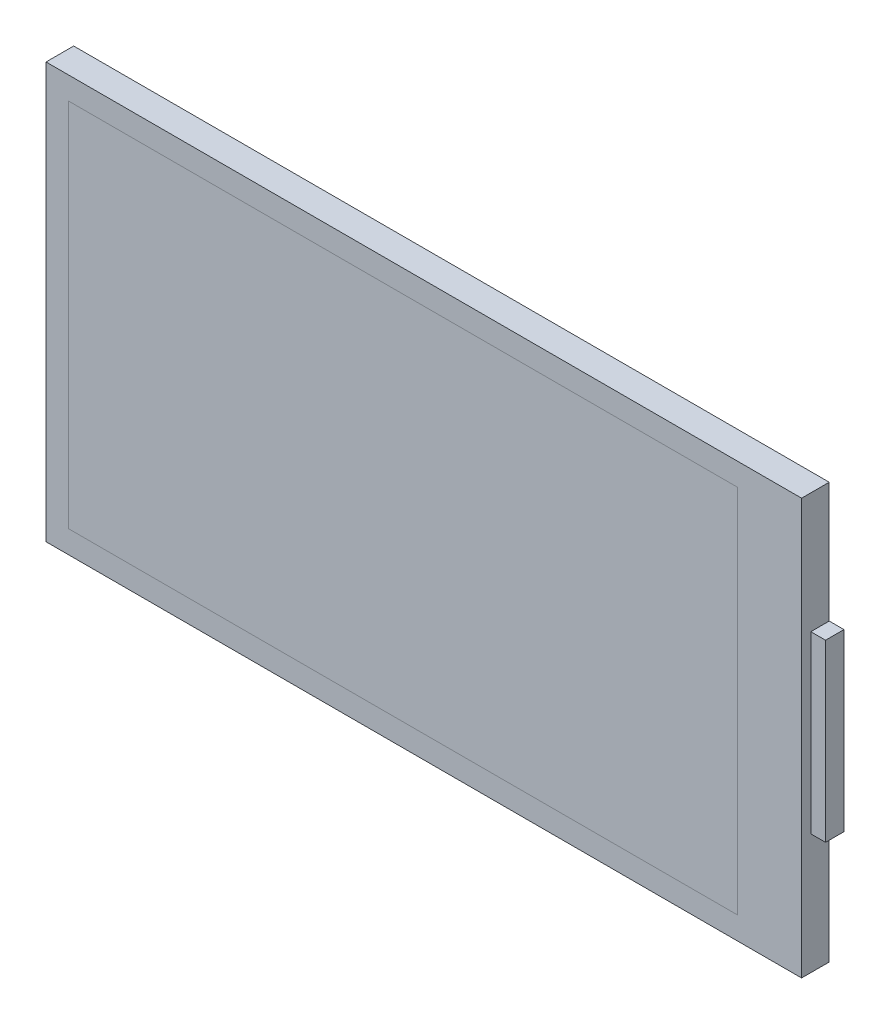
ISO-10303-21;
HEADER;
FILE_DESCRIPTION(('STEP AP214'),'2;1');
FILE_NAME('part.step','',(''),(''),'','','');
FILE_SCHEMA(('AUTOMOTIVE_DESIGN { 1 0 10303 214 1 1 1 1 }'));
ENDSEC;
DATA;
#1=APPLICATION_CONTEXT('core data for automotive mechanical design processes');
#2=APPLICATION_PROTOCOL_DEFINITION('international standard','automotive_design',2000,#1);
#3=PRODUCT_CONTEXT('',#1,'mechanical');
#4=PRODUCT('Part','Part','',(#3));
#5=PRODUCT_RELATED_PRODUCT_CATEGORY('part','',(#4));
#6=PRODUCT_DEFINITION_FORMATION('','',#4);
#7=PRODUCT_DEFINITION_CONTEXT('part definition',#1,'design');
#8=PRODUCT_DEFINITION('design','',#6,#7);
#9=PRODUCT_DEFINITION_SHAPE('','',#8);
#10=(LENGTH_UNIT() NAMED_UNIT(*) SI_UNIT(.MILLI.,.METRE.));
#11=(NAMED_UNIT(*) PLANE_ANGLE_UNIT() SI_UNIT($,.RADIAN.));
#12=(NAMED_UNIT(*) SI_UNIT($,.STERADIAN.) SOLID_ANGLE_UNIT());
#13=UNCERTAINTY_MEASURE_WITH_UNIT(LENGTH_MEASURE(1.E-05),#10,'distance_accuracy_value','');
#14=(GEOMETRIC_REPRESENTATION_CONTEXT(3) GLOBAL_UNCERTAINTY_ASSIGNED_CONTEXT((#13)) GLOBAL_UNIT_ASSIGNED_CONTEXT((#10,
#11,#12)) REPRESENTATION_CONTEXT('',''));
#15=CARTESIAN_POINT('',(0.,0.,0.));
#16=DIRECTION('',(0.,0.,1.));
#17=DIRECTION('',(1.,0.,0.));
#18=AXIS2_PLACEMENT_3D('',#15,#16,#17);
#19=CARTESIAN_POINT('',(0.,0.,0.));
#20=DIRECTION('',(0.,0.,1.));
#21=DIRECTION('',(1.,0.,0.));
#22=AXIS2_PLACEMENT_3D('',#19,#20,#21);
#23=PLANE('',#22);
#24=DIRECTION('',(0.,1.,0.));
#25=VECTOR('',#24,1.);
#26=CARTESIAN_POINT('',(-10.,-6.175,0.));
#27=LINE('',#26,#25);
#28=CARTESIAN_POINT('',(-10.,-20.55,0.));
#29=VERTEX_POINT('',#28);
#30=CARTESIAN_POINT('',(-10.,-20.1,0.));
#31=VERTEX_POINT('',#30);
#32=EDGE_CURVE('P0_E275',#29,#31,#27,.T.);
#33=ORIENTED_EDGE('',*,*,#32,.T.);
#34=DIRECTION('',(-1.,0.,0.));
#35=VECTOR('',#34,1.);
#36=CARTESIAN_POINT('',(34.05,-20.1,0.));
#37=LINE('',#36,#35);
#38=CARTESIAN_POINT('',(1.,-20.1,0.));
#39=VERTEX_POINT('',#38);
#40=EDGE_CURVE('P0_E270',#39,#31,#37,.T.);
#41=ORIENTED_EDGE('',*,*,#40,.F.);
#42=DIRECTION('',(0.,-1.,0.));
#43=VECTOR('',#42,1.);
#44=CARTESIAN_POINT('',(1.,-10.275,0.));
#45=LINE('',#44,#43);
#46=CARTESIAN_POINT('',(1.,-20.55,0.));
#47=VERTEX_POINT('',#46);
#48=EDGE_CURVE('P0_E348',#39,#47,#45,.T.);
#49=ORIENTED_EDGE('',*,*,#48,.T.);
#50=DIRECTION('',(1.,0.,0.));
#51=VECTOR('',#50,1.);
#52=CARTESIAN_POINT('',(9.25,-20.55,0.));
#53=LINE('',#52,#51);
#54=CARTESIAN_POINT('',(18.5,-20.55,0.));
#55=VERTEX_POINT('',#54);
#56=EDGE_CURVE('P0_E21',#47,#55,#53,.T.);
#57=ORIENTED_EDGE('',*,*,#56,.T.);
#58=DIRECTION('',(0.,1.,0.));
#59=VECTOR('',#58,1.);
#60=CARTESIAN_POINT('',(18.5,-6.175,0.));
#61=LINE('',#60,#59);
#62=CARTESIAN_POINT('',(18.5,-20.1,0.));
#63=VERTEX_POINT('',#62);
#64=EDGE_CURVE('P0_E306',#55,#63,#61,.T.);
#65=ORIENTED_EDGE('',*,*,#64,.T.);
#66=DIRECTION('',(-1.,0.,0.));
#67=VECTOR('',#66,1.);
#68=CARTESIAN_POINT('',(34.05,-20.1,0.));
#69=LINE('',#68,#67);
#70=CARTESIAN_POINT('',(34.05,-20.1,0.));
#71=VERTEX_POINT('',#70);
#72=EDGE_CURVE('P0_E267',#71,#63,#69,.T.);
#73=ORIENTED_EDGE('',*,*,#72,.F.);
#74=DIRECTION('',(0.,-1.,0.));
#75=VECTOR('',#74,1.);
#76=CARTESIAN_POINT('',(34.05,20.1,0.));
#77=LINE('',#76,#75);
#78=CARTESIAN_POINT('',(34.05,20.1,0.));
#79=VERTEX_POINT('',#78);
#80=EDGE_CURVE('P0_E247',#79,#71,#77,.T.);
#81=ORIENTED_EDGE('',*,*,#80,.F.);
#82=DIRECTION('',(1.,0.,0.));
#83=VECTOR('',#82,1.);
#84=CARTESIAN_POINT('',(-38.55,20.1,0.));
#85=LINE('',#84,#83);
#86=CARTESIAN_POINT('',(-38.55,20.1,0.));
#87=VERTEX_POINT('',#86);
#88=EDGE_CURVE('P0_E232',#87,#79,#85,.T.);
#89=ORIENTED_EDGE('',*,*,#88,.F.);
#90=DIRECTION('',(0.,1.,0.));
#91=VECTOR('',#90,1.);
#92=CARTESIAN_POINT('',(-38.55,-20.1,0.));
#93=LINE('',#92,#91);
#94=CARTESIAN_POINT('',(-38.55,-20.1,0.));
#95=VERTEX_POINT('',#94);
#96=EDGE_CURVE('P0_E330',#95,#87,#93,.T.);
#97=ORIENTED_EDGE('',*,*,#96,.F.);
#98=DIRECTION('',(-1.,0.,0.));
#99=VECTOR('',#98,1.);
#100=CARTESIAN_POINT('',(34.05,-20.1,0.));
#101=LINE('',#100,#99);
#102=CARTESIAN_POINT('',(-25.,-20.1,0.));
#103=VERTEX_POINT('',#102);
#104=EDGE_CURVE('P0_E301',#103,#95,#101,.T.);
#105=ORIENTED_EDGE('',*,*,#104,.F.);
#106=DIRECTION('',(0.,-1.,0.));
#107=VECTOR('',#106,1.);
#108=CARTESIAN_POINT('',(-25.,-10.275,0.));
#109=LINE('',#108,#107);
#110=CARTESIAN_POINT('',(-25.,-20.55,0.));
#111=VERTEX_POINT('',#110);
#112=EDGE_CURVE('P0_E354',#103,#111,#109,.T.);
#113=ORIENTED_EDGE('',*,*,#112,.T.);
#114=DIRECTION('',(1.,0.,0.));
#115=VECTOR('',#114,1.);
#116=CARTESIAN_POINT('',(-5.,-20.55,0.));
#117=LINE('',#116,#115);
#118=EDGE_CURVE('P0_E262',#111,#29,#117,.T.);
#119=ORIENTED_EDGE('',*,*,#118,.T.);
#120=EDGE_LOOP('',(#33,#41,#49,#57,#65,#73,#81,#89,#97,#105,#113,#119));
#121=FACE_BOUND('',#120,.T.);
#122=DIRECTION('',(0.,-1.,0.));
#123=VECTOR('',#122,1.);
#124=CARTESIAN_POINT('',(-41.,22.55,0.));
#125=LINE('',#124,#123);
#126=CARTESIAN_POINT('',(-41.,22.55,0.));
#127=VERTEX_POINT('',#126);
#128=CARTESIAN_POINT('',(-41.,-22.55,0.));
#129=VERTEX_POINT('',#128);
#130=EDGE_CURVE('P0_E28',#127,#129,#125,.T.);
#131=ORIENTED_EDGE('',*,*,#130,.F.);
#132=DIRECTION('',(-1.,0.,0.));
#133=VECTOR('',#132,1.);
#134=CARTESIAN_POINT('',(41.,22.55,0.));
#135=LINE('',#134,#133);
#136=CARTESIAN_POINT('',(41.,22.55,0.));
#137=VERTEX_POINT('',#136);
#138=EDGE_CURVE('P0_E231',#137,#127,#135,.T.);
#139=ORIENTED_EDGE('',*,*,#138,.F.);
#140=DIRECTION('',(0.,1.,0.));
#141=VECTOR('',#140,1.);
#142=CARTESIAN_POINT('',(41.,-22.55,0.));
#143=LINE('',#142,#141);
#144=CARTESIAN_POINT('',(41.,9.50000014156103,0.));
#145=VERTEX_POINT('',#144);
#146=EDGE_CURVE('P0_E212',#145,#137,#143,.T.);
#147=ORIENTED_EDGE('',*,*,#146,.F.);
#148=DIRECTION('',(-1.,0.,0.));
#149=VECTOR('',#148,1.);
#150=CARTESIAN_POINT('',(42.6,9.50000014156103,0.));
#151=LINE('',#150,#149);
#152=CARTESIAN_POINT('',(42.6,9.50000014156103,0.));
#153=VERTEX_POINT('',#152);
#154=EDGE_CURVE('P0_E331',#153,#145,#151,.T.);
#155=ORIENTED_EDGE('',*,*,#154,.F.);
#156=DIRECTION('',(0.,-1.,0.));
#157=VECTOR('',#156,1.);
#158=CARTESIAN_POINT('',(42.6,9.50000014156103,0.));
#159=LINE('',#158,#157);
#160=CARTESIAN_POINT('',(42.6,-9.50000014156103,0.));
#161=VERTEX_POINT('',#160);
#162=EDGE_CURVE('P0_E278',#153,#161,#159,.T.);
#163=ORIENTED_EDGE('',*,*,#162,.T.);
#164=DIRECTION('',(-1.,0.,0.));
#165=VECTOR('',#164,1.);
#166=CARTESIAN_POINT('',(42.6,-9.50000014156103,0.));
#167=LINE('',#166,#165);
#168=CARTESIAN_POINT('',(41.,-9.50000014156103,0.));
#169=VERTEX_POINT('',#168);
#170=EDGE_CURVE('P0_E311',#161,#169,#167,.T.);
#171=ORIENTED_EDGE('',*,*,#170,.T.);
#172=DIRECTION('',(0.,1.,0.));
#173=VECTOR('',#172,1.);
#174=CARTESIAN_POINT('',(41.,-22.55,0.));
#175=LINE('',#174,#173);
#176=CARTESIAN_POINT('',(41.,-22.55,0.));
#177=VERTEX_POINT('',#176);
#178=EDGE_CURVE('P0_E161',#177,#169,#175,.T.);
#179=ORIENTED_EDGE('',*,*,#178,.F.);
#180=DIRECTION('',(1.,0.,0.));
#181=VECTOR('',#180,1.);
#182=CARTESIAN_POINT('',(-41.,-22.55,0.));
#183=LINE('',#182,#181);
#184=EDGE_CURVE('P0_E260',#129,#177,#183,.T.);
#185=ORIENTED_EDGE('',*,*,#184,.F.);
#186=EDGE_LOOP('',(#131,#139,#147,#155,#163,#171,#179,#185));
#187=FACE_BOUND('',#186,.T.);
#188=ADVANCED_FACE('P0_F17',(#121,#187),#23,.F.);
#189=CARTESIAN_POINT('',(0.,0.,3.));
#190=DIRECTION('',(0.,0.,1.));
#191=DIRECTION('',(1.,0.,0.));
#192=AXIS2_PLACEMENT_3D('',#189,#190,#191);
#193=PLANE('',#192);
#194=DIRECTION('',(1.,0.,0.));
#195=VECTOR('',#194,1.);
#196=CARTESIAN_POINT('',(-38.55,20.1,3.));
#197=LINE('',#196,#195);
#198=CARTESIAN_POINT('',(-38.55,20.1,3.));
#199=VERTEX_POINT('',#198);
#200=CARTESIAN_POINT('',(34.05,20.1,3.));
#201=VERTEX_POINT('',#200);
#202=EDGE_CURVE('P0_E219',#199,#201,#197,.T.);
#203=ORIENTED_EDGE('',*,*,#202,.T.);
#204=DIRECTION('',(0.,-1.,0.));
#205=VECTOR('',#204,1.);
#206=CARTESIAN_POINT('',(34.05,20.1,3.));
#207=LINE('',#206,#205);
#208=CARTESIAN_POINT('',(34.05,-20.1,3.));
#209=VERTEX_POINT('',#208);
#210=EDGE_CURVE('P0_E223',#201,#209,#207,.T.);
#211=ORIENTED_EDGE('',*,*,#210,.T.);
#212=DIRECTION('',(-1.,0.,0.));
#213=VECTOR('',#212,1.);
#214=CARTESIAN_POINT('',(34.05,-20.1,3.));
#215=LINE('',#214,#213);
#216=CARTESIAN_POINT('',(-38.55,-20.1,3.));
#217=VERTEX_POINT('',#216);
#218=EDGE_CURVE('P0_E320',#209,#217,#215,.T.);
#219=ORIENTED_EDGE('',*,*,#218,.T.);
#220=DIRECTION('',(0.,1.,0.));
#221=VECTOR('',#220,1.);
#222=CARTESIAN_POINT('',(-38.55,-20.1,3.));
#223=LINE('',#222,#221);
#224=EDGE_CURVE('P0_E226',#217,#199,#223,.T.);
#225=ORIENTED_EDGE('',*,*,#224,.T.);
#226=EDGE_LOOP('',(#203,#211,#219,#225));
#227=FACE_BOUND('',#226,.T.);
#228=DIRECTION('',(0.,-1.,0.));
#229=VECTOR('',#228,1.);
#230=CARTESIAN_POINT('',(-41.,22.55,3.));
#231=LINE('',#230,#229);
#232=CARTESIAN_POINT('',(-41.,22.55,3.));
#233=VERTEX_POINT('',#232);
#234=CARTESIAN_POINT('',(-41.,-22.55,3.));
#235=VERTEX_POINT('',#234);
#236=EDGE_CURVE('P0_E11',#233,#235,#231,.T.);
#237=ORIENTED_EDGE('',*,*,#236,.T.);
#238=DIRECTION('',(1.,0.,0.));
#239=VECTOR('',#238,1.);
#240=CARTESIAN_POINT('',(-41.,-22.55,3.));
#241=LINE('',#240,#239);
#242=CARTESIAN_POINT('',(41.,-22.55,3.));
#243=VERTEX_POINT('',#242);
#244=EDGE_CURVE('P0_E116',#235,#243,#241,.T.);
#245=ORIENTED_EDGE('',*,*,#244,.T.);
#246=DIRECTION('',(0.,1.,0.));
#247=VECTOR('',#246,1.);
#248=CARTESIAN_POINT('',(41.,-22.55,3.));
#249=LINE('',#248,#247);
#250=CARTESIAN_POINT('',(41.,22.55,3.));
#251=VERTEX_POINT('',#250);
#252=EDGE_CURVE('P0_E124',#243,#251,#249,.T.);
#253=ORIENTED_EDGE('',*,*,#252,.T.);
#254=DIRECTION('',(-1.,0.,0.));
#255=VECTOR('',#254,1.);
#256=CARTESIAN_POINT('',(41.,22.55,3.));
#257=LINE('',#256,#255);
#258=EDGE_CURVE('P0_E394',#251,#233,#257,.T.);
#259=ORIENTED_EDGE('',*,*,#258,.T.);
#260=EDGE_LOOP('',(#237,#245,#253,#259));
#261=FACE_BOUND('',#260,.T.);
#262=ADVANCED_FACE('P0_F221',(#227,#261),#193,.T.);
#263=CARTESIAN_POINT('',(-41.,22.55,0.));
#264=DIRECTION('',(-1.,0.,0.));
#265=DIRECTION('',(0.,0.,1.));
#266=AXIS2_PLACEMENT_3D('',#263,#264,#265);
#267=PLANE('',#266);
#268=ORIENTED_EDGE('',*,*,#130,.T.);
#269=DIRECTION('',(0.,0.,1.));
#270=VECTOR('',#269,1.);
#271=CARTESIAN_POINT('',(-41.,-22.55,0.));
#272=LINE('',#271,#270);
#273=EDGE_CURVE('P0_E385',#129,#235,#272,.T.);
#274=ORIENTED_EDGE('',*,*,#273,.T.);
#275=ORIENTED_EDGE('',*,*,#236,.F.);
#276=DIRECTION('',(0.,0.,1.));
#277=VECTOR('',#276,1.);
#278=CARTESIAN_POINT('',(-41.,22.55,0.));
#279=LINE('',#278,#277);
#280=EDGE_CURVE('P0_E298',#127,#233,#279,.T.);
#281=ORIENTED_EDGE('',*,*,#280,.F.);
#282=EDGE_LOOP('',(#268,#274,#275,#281));
#283=FACE_BOUND('',#282,.T.);
#284=ADVANCED_FACE('P0_F501',(#283),#267,.T.);
#285=CARTESIAN_POINT('',(-41.,-22.55,0.));
#286=DIRECTION('',(0.,-1.,0.));
#287=DIRECTION('',(0.,0.,-1.));
#288=AXIS2_PLACEMENT_3D('',#285,#286,#287);
#289=PLANE('',#288);
#290=ORIENTED_EDGE('',*,*,#184,.T.);
#291=DIRECTION('',(0.,0.,1.));
#292=VECTOR('',#291,1.);
#293=CARTESIAN_POINT('',(41.,-22.55,0.));
#294=LINE('',#293,#292);
#295=EDGE_CURVE('P0_E261',#177,#243,#294,.T.);
#296=ORIENTED_EDGE('',*,*,#295,.T.);
#297=ORIENTED_EDGE('',*,*,#244,.F.);
#298=ORIENTED_EDGE('',*,*,#273,.F.);
#299=EDGE_LOOP('',(#290,#296,#297,#298));
#300=FACE_BOUND('',#299,.T.);
#301=ADVANCED_FACE('P0_F493',(#300),#289,.T.);
#302=CARTESIAN_POINT('',(41.,-22.55,0.));
#303=DIRECTION('',(1.,0.,0.));
#304=DIRECTION('',(0.,1.,0.));
#305=AXIS2_PLACEMENT_3D('',#302,#303,#304);
#306=PLANE('',#305);
#307=DIRECTION('',(0.,0.,-1.));
#308=VECTOR('',#307,1.);
#309=CARTESIAN_POINT('',(41.,9.50000014156103,0.));
#310=LINE('',#309,#308);
#311=CARTESIAN_POINT('',(41.,9.50000014156103,2.));
#312=VERTEX_POINT('',#311);
#313=EDGE_CURVE('P0_E335',#312,#145,#310,.T.);
#314=ORIENTED_EDGE('',*,*,#313,.T.);
#315=ORIENTED_EDGE('',*,*,#146,.T.);
#316=DIRECTION('',(0.,0.,1.));
#317=VECTOR('',#316,1.);
#318=CARTESIAN_POINT('',(41.,22.55,0.));
#319=LINE('',#318,#317);
#320=EDGE_CURVE('P0_E367',#137,#251,#319,.T.);
#321=ORIENTED_EDGE('',*,*,#320,.T.);
#322=ORIENTED_EDGE('',*,*,#252,.F.);
#323=ORIENTED_EDGE('',*,*,#295,.F.);
#324=ORIENTED_EDGE('',*,*,#178,.T.);
#325=DIRECTION('',(0.,0.,1.));
#326=VECTOR('',#325,1.);
#327=CARTESIAN_POINT('',(41.,-9.50000014156103,0.));
#328=LINE('',#327,#326);
#329=CARTESIAN_POINT('',(41.,-9.50000014156103,2.));
#330=VERTEX_POINT('',#329);
#331=EDGE_CURVE('P0_E310',#169,#330,#328,.T.);
#332=ORIENTED_EDGE('',*,*,#331,.T.);
#333=DIRECTION('',(0.,1.,0.));
#334=VECTOR('',#333,1.);
#335=CARTESIAN_POINT('',(41.,-11.275,2.));
#336=LINE('',#335,#334);
#337=EDGE_CURVE('P0_E146',#330,#312,#336,.T.);
#338=ORIENTED_EDGE('',*,*,#337,.T.);
#339=EDGE_LOOP('',(#314,#315,#321,#322,#323,#324,#332,#338));
#340=FACE_BOUND('',#339,.T.);
#341=ADVANCED_FACE('P0_F490',(#340),#306,.T.);
#342=CARTESIAN_POINT('',(41.,22.55,0.));
#343=DIRECTION('',(0.,1.,0.));
#344=DIRECTION('',(1.,0.,0.));
#345=AXIS2_PLACEMENT_3D('',#342,#343,#344);
#346=PLANE('',#345);
#347=ORIENTED_EDGE('',*,*,#138,.T.);
#348=ORIENTED_EDGE('',*,*,#280,.T.);
#349=ORIENTED_EDGE('',*,*,#258,.F.);
#350=ORIENTED_EDGE('',*,*,#320,.F.);
#351=EDGE_LOOP('',(#347,#348,#349,#350));
#352=FACE_BOUND('',#351,.T.);
#353=ADVANCED_FACE('P0_F492',(#352),#346,.T.);
#354=CARTESIAN_POINT('',(-38.55,20.1,0.));
#355=DIRECTION('',(0.,-1.,0.));
#356=DIRECTION('',(0.,0.,-1.));
#357=AXIS2_PLACEMENT_3D('',#354,#355,#356);
#358=PLANE('',#357);
#359=ORIENTED_EDGE('',*,*,#88,.T.);
#360=DIRECTION('',(0.,0.,1.));
#361=VECTOR('',#360,1.);
#362=CARTESIAN_POINT('',(34.05,20.1,0.));
#363=LINE('',#362,#361);
#364=EDGE_CURVE('P0_E235',#79,#201,#363,.T.);
#365=ORIENTED_EDGE('',*,*,#364,.T.);
#366=ORIENTED_EDGE('',*,*,#202,.F.);
#367=DIRECTION('',(0.,0.,1.));
#368=VECTOR('',#367,1.);
#369=CARTESIAN_POINT('',(-38.55,20.1,0.));
#370=LINE('',#369,#368);
#371=EDGE_CURVE('P0_E327',#87,#199,#370,.T.);
#372=ORIENTED_EDGE('',*,*,#371,.F.);
#373=EDGE_LOOP('',(#359,#365,#366,#372));
#374=FACE_BOUND('',#373,.T.);
#375=ADVANCED_FACE('P0_F236',(#374),#358,.T.);
#376=CARTESIAN_POINT('',(34.05,20.1,0.));
#377=DIRECTION('',(-1.,0.,0.));
#378=DIRECTION('',(0.,0.,1.));
#379=AXIS2_PLACEMENT_3D('',#376,#377,#378);
#380=PLANE('',#379);
#381=ORIENTED_EDGE('',*,*,#80,.T.);
#382=DIRECTION('',(0.,0.,1.));
#383=VECTOR('',#382,1.);
#384=CARTESIAN_POINT('',(34.05,-20.1,0.));
#385=LINE('',#384,#383);
#386=EDGE_CURVE('P0_E244',#71,#209,#385,.T.);
#387=ORIENTED_EDGE('',*,*,#386,.T.);
#388=ORIENTED_EDGE('',*,*,#210,.F.);
#389=ORIENTED_EDGE('',*,*,#364,.F.);
#390=EDGE_LOOP('',(#381,#387,#388,#389));
#391=FACE_BOUND('',#390,.T.);
#392=ADVANCED_FACE('P0_F242',(#391),#380,.T.);
#393=CARTESIAN_POINT('',(34.05,-20.1,0.));
#394=DIRECTION('',(0.,1.,0.));
#395=DIRECTION('',(1.,0.,0.));
#396=AXIS2_PLACEMENT_3D('',#393,#394,#395);
#397=PLANE('',#396);
#398=ORIENTED_EDGE('',*,*,#72,.T.);
#399=DIRECTION('',(-1.,0.,0.));
#400=VECTOR('',#399,1.);
#401=CARTESIAN_POINT('',(34.05,-20.1,0.));
#402=LINE('',#401,#400);
#403=EDGE_CURVE('P0_E415',#63,#39,#402,.T.);
#404=ORIENTED_EDGE('',*,*,#403,.T.);
#405=ORIENTED_EDGE('',*,*,#40,.T.);
#406=DIRECTION('',(-1.,0.,0.));
#407=VECTOR('',#406,1.);
#408=CARTESIAN_POINT('',(34.05,-20.1,0.));
#409=LINE('',#408,#407);
#410=EDGE_CURVE('P0_E358',#31,#103,#409,.T.);
#411=ORIENTED_EDGE('',*,*,#410,.T.);
#412=ORIENTED_EDGE('',*,*,#104,.T.);
#413=DIRECTION('',(0.,0.,1.));
#414=VECTOR('',#413,1.);
#415=CARTESIAN_POINT('',(-38.55,-20.1,0.));
#416=LINE('',#415,#414);
#417=EDGE_CURVE('P0_E271',#95,#217,#416,.T.);
#418=ORIENTED_EDGE('',*,*,#417,.T.);
#419=ORIENTED_EDGE('',*,*,#218,.F.);
#420=ORIENTED_EDGE('',*,*,#386,.F.);
#421=EDGE_LOOP('',(#398,#404,#405,#411,#412,#418,#419,#420));
#422=FACE_BOUND('',#421,.T.);
#423=ADVANCED_FACE('P0_F541',(#422),#397,.T.);
#424=CARTESIAN_POINT('',(-38.55,-20.1,0.));
#425=DIRECTION('',(1.,0.,0.));
#426=DIRECTION('',(0.,1.,0.));
#427=AXIS2_PLACEMENT_3D('',#424,#425,#426);
#428=PLANE('',#427);
#429=ORIENTED_EDGE('',*,*,#96,.T.);
#430=ORIENTED_EDGE('',*,*,#371,.T.);
#431=ORIENTED_EDGE('',*,*,#224,.F.);
#432=ORIENTED_EDGE('',*,*,#417,.F.);
#433=EDGE_LOOP('',(#429,#430,#431,#432));
#434=FACE_BOUND('',#433,.T.);
#435=ADVANCED_FACE('P0_F518',(#434),#428,.T.);
#436=CARTESIAN_POINT('',(9.75,-16.45,-6.));
#437=DIRECTION('',(0.,0.,-1.));
#438=DIRECTION('',(0.,-1.,0.));
#439=AXIS2_PLACEMENT_3D('',#436,#437,#438);
#440=PLANE('',#439);
#441=DIRECTION('',(0.,1.,0.));
#442=VECTOR('',#441,1.);
#443=CARTESIAN_POINT('',(1.,-12.35,-6.));
#444=LINE('',#443,#442);
#445=CARTESIAN_POINT('',(1.,-20.55,-6.));
#446=VERTEX_POINT('',#445);
#447=CARTESIAN_POINT('',(1.,-12.35,-6.));
#448=VERTEX_POINT('',#447);
#449=EDGE_CURVE('P0_E345',#446,#448,#444,.T.);
#450=ORIENTED_EDGE('',*,*,#449,.T.);
#451=DIRECTION('',(1.,0.,0.));
#452=VECTOR('',#451,1.);
#453=CARTESIAN_POINT('',(18.5,-12.35,-6.));
#454=LINE('',#453,#452);
#455=CARTESIAN_POINT('',(18.5,-12.35,-6.));
#456=VERTEX_POINT('',#455);
#457=EDGE_CURVE('P0_E414',#448,#456,#454,.T.);
#458=ORIENTED_EDGE('',*,*,#457,.T.);
#459=DIRECTION('',(0.,-1.,0.));
#460=VECTOR('',#459,1.);
#461=CARTESIAN_POINT('',(18.5,-20.55,-6.));
#462=LINE('',#461,#460);
#463=CARTESIAN_POINT('',(18.5,-20.55,-6.));
#464=VERTEX_POINT('',#463);
#465=EDGE_CURVE('P0_E341',#456,#464,#462,.T.);
#466=ORIENTED_EDGE('',*,*,#465,.T.);
#467=DIRECTION('',(-1.,0.,0.));
#468=VECTOR('',#467,1.);
#469=CARTESIAN_POINT('',(1.,-20.55,-6.));
#470=LINE('',#469,#468);
#471=EDGE_CURVE('P0_E290',#464,#446,#470,.T.);
#472=ORIENTED_EDGE('',*,*,#471,.T.);
#473=EDGE_LOOP('',(#450,#458,#466,#472));
#474=FACE_BOUND('',#473,.T.);
#475=ADVANCED_FACE('P0_F515',(#474),#440,.T.);
#476=CARTESIAN_POINT('',(9.75,-16.45,0.));
#477=DIRECTION('',(0.,0.,1.));
#478=DIRECTION('',(1.,0.,0.));
#479=AXIS2_PLACEMENT_3D('',#476,#477,#478);
#480=PLANE('',#479);
#481=ORIENTED_EDGE('',*,*,#403,.F.);
#482=DIRECTION('',(0.,1.,0.));
#483=VECTOR('',#482,1.);
#484=CARTESIAN_POINT('',(18.5,-20.55,0.));
#485=LINE('',#484,#483);
#486=CARTESIAN_POINT('',(18.5,-12.35,0.));
#487=VERTEX_POINT('',#486);
#488=EDGE_CURVE('P0_E321',#63,#487,#485,.T.);
#489=ORIENTED_EDGE('',*,*,#488,.T.);
#490=DIRECTION('',(-1.,0.,0.));
#491=VECTOR('',#490,1.);
#492=CARTESIAN_POINT('',(18.5,-12.35,0.));
#493=LINE('',#492,#491);
#494=CARTESIAN_POINT('',(1.,-12.35,0.));
#495=VERTEX_POINT('',#494);
#496=EDGE_CURVE('P0_E325',#487,#495,#493,.T.);
#497=ORIENTED_EDGE('',*,*,#496,.T.);
#498=DIRECTION('',(0.,-1.,0.));
#499=VECTOR('',#498,1.);
#500=CARTESIAN_POINT('',(1.,-12.35,0.));
#501=LINE('',#500,#499);
#502=EDGE_CURVE('P0_E349',#495,#39,#501,.T.);
#503=ORIENTED_EDGE('',*,*,#502,.T.);
#504=EDGE_LOOP('',(#481,#489,#497,#503));
#505=FACE_BOUND('',#504,.T.);
#506=ADVANCED_FACE('P0_F517',(#505),#480,.T.);
#507=CARTESIAN_POINT('',(1.,-20.55,0.));
#508=DIRECTION('',(-1.,0.,0.));
#509=DIRECTION('',(0.,0.,1.));
#510=AXIS2_PLACEMENT_3D('',#507,#508,#509);
#511=PLANE('',#510);
#512=ORIENTED_EDGE('',*,*,#502,.F.);
#513=DIRECTION('',(0.,0.,-1.));
#514=VECTOR('',#513,1.);
#515=CARTESIAN_POINT('',(1.,-12.35,0.));
#516=LINE('',#515,#514);
#517=EDGE_CURVE('P0_E374',#495,#448,#516,.T.);
#518=ORIENTED_EDGE('',*,*,#517,.T.);
#519=ORIENTED_EDGE('',*,*,#449,.F.);
#520=DIRECTION('',(0.,0.,-1.));
#521=VECTOR('',#520,1.);
#522=CARTESIAN_POINT('',(1.,-20.55,0.));
#523=LINE('',#522,#521);
#524=EDGE_CURVE('P0_E286',#47,#446,#523,.T.);
#525=ORIENTED_EDGE('',*,*,#524,.F.);
#526=ORIENTED_EDGE('',*,*,#48,.F.);
#527=EDGE_LOOP('',(#512,#518,#519,#525,#526));
#528=FACE_BOUND('',#527,.T.);
#529=ADVANCED_FACE('P0_F524',(#528),#511,.T.);
#530=CARTESIAN_POINT('',(1.,-12.35,0.));
#531=DIRECTION('',(0.,1.,0.));
#532=DIRECTION('',(1.,0.,0.));
#533=AXIS2_PLACEMENT_3D('',#530,#531,#532);
#534=PLANE('',#533);
#535=ORIENTED_EDGE('',*,*,#496,.F.);
#536=DIRECTION('',(0.,0.,-1.));
#537=VECTOR('',#536,1.);
#538=CARTESIAN_POINT('',(18.5,-12.35,0.));
#539=LINE('',#538,#537);
#540=EDGE_CURVE('P0_E326',#487,#456,#539,.T.);
#541=ORIENTED_EDGE('',*,*,#540,.T.);
#542=ORIENTED_EDGE('',*,*,#457,.F.);
#543=ORIENTED_EDGE('',*,*,#517,.F.);
#544=EDGE_LOOP('',(#535,#541,#542,#543));
#545=FACE_BOUND('',#544,.T.);
#546=ADVANCED_FACE('P0_F521',(#545),#534,.T.);
#547=CARTESIAN_POINT('',(18.5,-12.35,0.));
#548=DIRECTION('',(1.,0.,0.));
#549=DIRECTION('',(0.,1.,0.));
#550=AXIS2_PLACEMENT_3D('',#547,#548,#549);
#551=PLANE('',#550);
#552=ORIENTED_EDGE('',*,*,#64,.F.);
#553=DIRECTION('',(0.,0.,-1.));
#554=VECTOR('',#553,1.);
#555=CARTESIAN_POINT('',(18.5,-20.55,0.));
#556=LINE('',#555,#554);
#557=EDGE_CURVE('P0_E302',#55,#464,#556,.T.);
#558=ORIENTED_EDGE('',*,*,#557,.T.);
#559=ORIENTED_EDGE('',*,*,#465,.F.);
#560=ORIENTED_EDGE('',*,*,#540,.F.);
#561=ORIENTED_EDGE('',*,*,#488,.F.);
#562=EDGE_LOOP('',(#552,#558,#559,#560,#561));
#563=FACE_BOUND('',#562,.T.);
#564=ADVANCED_FACE('P0_F19',(#563),#551,.T.);
#565=CARTESIAN_POINT('',(18.5,-20.55,0.));
#566=DIRECTION('',(0.,-1.,0.));
#567=DIRECTION('',(0.,0.,-1.));
#568=AXIS2_PLACEMENT_3D('',#565,#566,#567);
#569=PLANE('',#568);
#570=ORIENTED_EDGE('',*,*,#56,.F.);
#571=ORIENTED_EDGE('',*,*,#524,.T.);
#572=ORIENTED_EDGE('',*,*,#471,.F.);
#573=ORIENTED_EDGE('',*,*,#557,.F.);
#574=EDGE_LOOP('',(#570,#571,#572,#573));
#575=FACE_BOUND('',#574,.T.);
#576=ADVANCED_FACE('P0_F537',(#575),#569,.T.);
#577=CARTESIAN_POINT('',(-17.5,-16.45,-6.));
#578=DIRECTION('',(0.,0.,-1.));
#579=DIRECTION('',(0.,-1.,0.));
#580=AXIS2_PLACEMENT_3D('',#577,#578,#579);
#581=PLANE('',#580);
#582=DIRECTION('',(0.,1.,0.));
#583=VECTOR('',#582,1.);
#584=CARTESIAN_POINT('',(-25.,-12.35,-6.));
#585=LINE('',#584,#583);
#586=CARTESIAN_POINT('',(-25.,-20.55,-6.));
#587=VERTEX_POINT('',#586);
#588=CARTESIAN_POINT('',(-25.,-12.35,-6.));
#589=VERTEX_POINT('',#588);
#590=EDGE_CURVE('P0_E359',#587,#589,#585,.T.);
#591=ORIENTED_EDGE('',*,*,#590,.T.);
#592=DIRECTION('',(1.,0.,0.));
#593=VECTOR('',#592,1.);
#594=CARTESIAN_POINT('',(-10.,-12.35,-6.));
#595=LINE('',#594,#593);
#596=CARTESIAN_POINT('',(-10.,-12.35,-6.));
#597=VERTEX_POINT('',#596);
#598=EDGE_CURVE('P0_E317',#589,#597,#595,.T.);
#599=ORIENTED_EDGE('',*,*,#598,.T.);
#600=DIRECTION('',(0.,-1.,0.));
#601=VECTOR('',#600,1.);
#602=CARTESIAN_POINT('',(-10.,-20.55,-6.));
#603=LINE('',#602,#601);
#604=CARTESIAN_POINT('',(-10.,-20.55,-6.));
#605=VERTEX_POINT('',#604);
#606=EDGE_CURVE('P0_E350',#597,#605,#603,.T.);
#607=ORIENTED_EDGE('',*,*,#606,.T.);
#608=DIRECTION('',(-1.,0.,0.));
#609=VECTOR('',#608,1.);
#610=CARTESIAN_POINT('',(-25.,-20.55,-6.));
#611=LINE('',#610,#609);
#612=EDGE_CURVE('P0_E276',#605,#587,#611,.T.);
#613=ORIENTED_EDGE('',*,*,#612,.T.);
#614=EDGE_LOOP('',(#591,#599,#607,#613));
#615=FACE_BOUND('',#614,.T.);
#616=ADVANCED_FACE('P0_F533',(#615),#581,.T.);
#617=CARTESIAN_POINT('',(-17.5,-16.45,0.));
#618=DIRECTION('',(0.,0.,1.));
#619=DIRECTION('',(1.,0.,0.));
#620=AXIS2_PLACEMENT_3D('',#617,#618,#619);
#621=PLANE('',#620);
#622=ORIENTED_EDGE('',*,*,#410,.F.);
#623=DIRECTION('',(0.,1.,0.));
#624=VECTOR('',#623,1.);
#625=CARTESIAN_POINT('',(-10.,-20.55,0.));
#626=LINE('',#625,#624);
#627=CARTESIAN_POINT('',(-10.,-12.35,0.));
#628=VERTEX_POINT('',#627);
#629=EDGE_CURVE('P0_E379',#31,#628,#626,.T.);
#630=ORIENTED_EDGE('',*,*,#629,.T.);
#631=DIRECTION('',(-1.,0.,0.));
#632=VECTOR('',#631,1.);
#633=CARTESIAN_POINT('',(-10.,-12.35,0.));
#634=LINE('',#633,#632);
#635=CARTESIAN_POINT('',(-25.,-12.35,0.));
#636=VERTEX_POINT('',#635);
#637=EDGE_CURVE('P0_E375',#628,#636,#634,.T.);
#638=ORIENTED_EDGE('',*,*,#637,.T.);
#639=DIRECTION('',(0.,-1.,0.));
#640=VECTOR('',#639,1.);
#641=CARTESIAN_POINT('',(-25.,-12.35,0.));
#642=LINE('',#641,#640);
#643=EDGE_CURVE('P0_E316',#636,#103,#642,.T.);
#644=ORIENTED_EDGE('',*,*,#643,.T.);
#645=EDGE_LOOP('',(#622,#630,#638,#644));
#646=FACE_BOUND('',#645,.T.);
#647=ADVANCED_FACE('P0_F536',(#646),#621,.T.);
#648=CARTESIAN_POINT('',(-25.,-20.55,0.));
#649=DIRECTION('',(-1.,0.,0.));
#650=DIRECTION('',(0.,0.,1.));
#651=AXIS2_PLACEMENT_3D('',#648,#649,#650);
#652=PLANE('',#651);
#653=ORIENTED_EDGE('',*,*,#643,.F.);
#654=DIRECTION('',(0.,0.,-1.));
#655=VECTOR('',#654,1.);
#656=CARTESIAN_POINT('',(-25.,-12.35,0.));
#657=LINE('',#656,#655);
#658=EDGE_CURVE('P0_E312',#636,#589,#657,.T.);
#659=ORIENTED_EDGE('',*,*,#658,.T.);
#660=ORIENTED_EDGE('',*,*,#590,.F.);
#661=DIRECTION('',(0.,0.,-1.));
#662=VECTOR('',#661,1.);
#663=CARTESIAN_POINT('',(-25.,-20.55,0.));
#664=LINE('',#663,#662);
#665=EDGE_CURVE('P0_E266',#111,#587,#664,.T.);
#666=ORIENTED_EDGE('',*,*,#665,.F.);
#667=ORIENTED_EDGE('',*,*,#112,.F.);
#668=EDGE_LOOP('',(#653,#659,#660,#666,#667));
#669=FACE_BOUND('',#668,.T.);
#670=ADVANCED_FACE('P0_F545',(#669),#652,.T.);
#671=CARTESIAN_POINT('',(-25.,-12.35,0.));
#672=DIRECTION('',(0.,1.,0.));
#673=DIRECTION('',(1.,0.,0.));
#674=AXIS2_PLACEMENT_3D('',#671,#672,#673);
#675=PLANE('',#674);
#676=ORIENTED_EDGE('',*,*,#637,.F.);
#677=DIRECTION('',(0.,0.,-1.));
#678=VECTOR('',#677,1.);
#679=CARTESIAN_POINT('',(-10.,-12.35,0.));
#680=LINE('',#679,#678);
#681=EDGE_CURVE('P0_E353',#628,#597,#680,.T.);
#682=ORIENTED_EDGE('',*,*,#681,.T.);
#683=ORIENTED_EDGE('',*,*,#598,.F.);
#684=ORIENTED_EDGE('',*,*,#658,.F.);
#685=EDGE_LOOP('',(#676,#682,#683,#684));
#686=FACE_BOUND('',#685,.T.);
#687=ADVANCED_FACE('P0_F552',(#686),#675,.T.);
#688=CARTESIAN_POINT('',(-10.,-12.35,0.));
#689=DIRECTION('',(1.,0.,0.));
#690=DIRECTION('',(0.,1.,0.));
#691=AXIS2_PLACEMENT_3D('',#688,#689,#690);
#692=PLANE('',#691);
#693=ORIENTED_EDGE('',*,*,#32,.F.);
#694=DIRECTION('',(0.,0.,-1.));
#695=VECTOR('',#694,1.);
#696=CARTESIAN_POINT('',(-10.,-20.55,0.));
#697=LINE('',#696,#695);
#698=EDGE_CURVE('P0_E272',#29,#605,#697,.T.);
#699=ORIENTED_EDGE('',*,*,#698,.T.);
#700=ORIENTED_EDGE('',*,*,#606,.F.);
#701=ORIENTED_EDGE('',*,*,#681,.F.);
#702=ORIENTED_EDGE('',*,*,#629,.F.);
#703=EDGE_LOOP('',(#693,#699,#700,#701,#702));
#704=FACE_BOUND('',#703,.T.);
#705=ADVANCED_FACE('P0_F531',(#704),#692,.T.);
#706=CARTESIAN_POINT('',(-10.,-20.55,0.));
#707=DIRECTION('',(0.,-1.,0.));
#708=DIRECTION('',(0.,0.,-1.));
#709=AXIS2_PLACEMENT_3D('',#706,#707,#708);
#710=PLANE('',#709);
#711=ORIENTED_EDGE('',*,*,#118,.F.);
#712=ORIENTED_EDGE('',*,*,#665,.T.);
#713=ORIENTED_EDGE('',*,*,#612,.F.);
#714=ORIENTED_EDGE('',*,*,#698,.F.);
#715=EDGE_LOOP('',(#711,#712,#713,#714));
#716=FACE_BOUND('',#715,.T.);
#717=ADVANCED_FACE('P0_F528',(#716),#710,.T.);
#718=CARTESIAN_POINT('',(41.8,0.,2.));
#719=DIRECTION('',(0.,0.,1.));
#720=DIRECTION('',(1.,0.,0.));
#721=AXIS2_PLACEMENT_3D('',#718,#719,#720);
#722=PLANE('',#721);
#723=DIRECTION('',(-1.,0.,0.));
#724=VECTOR('',#723,1.);
#725=CARTESIAN_POINT('',(42.6,9.50000014156103,2.));
#726=LINE('',#725,#724);
#727=CARTESIAN_POINT('',(42.6,9.50000014156103,2.));
#728=VERTEX_POINT('',#727);
#729=EDGE_CURVE('P0_E364',#728,#312,#726,.T.);
#730=ORIENTED_EDGE('',*,*,#729,.T.);
#731=ORIENTED_EDGE('',*,*,#337,.F.);
#732=DIRECTION('',(1.,0.,0.));
#733=VECTOR('',#732,1.);
#734=CARTESIAN_POINT('',(42.6,-9.50000014156103,2.));
#735=LINE('',#734,#733);
#736=CARTESIAN_POINT('',(42.6,-9.50000014156103,2.));
#737=VERTEX_POINT('',#736);
#738=EDGE_CURVE('P0_E307',#330,#737,#735,.T.);
#739=ORIENTED_EDGE('',*,*,#738,.T.);
#740=DIRECTION('',(0.,1.,0.));
#741=VECTOR('',#740,1.);
#742=CARTESIAN_POINT('',(42.6,9.50000014156103,2.));
#743=LINE('',#742,#741);
#744=EDGE_CURVE('P0_E291',#737,#728,#743,.T.);
#745=ORIENTED_EDGE('',*,*,#744,.T.);
#746=EDGE_LOOP('',(#730,#731,#739,#745));
#747=FACE_BOUND('',#746,.T.);
#748=ADVANCED_FACE('P0_F486',(#747),#722,.T.);
#749=CARTESIAN_POINT('',(42.6,9.50000014156103,0.));
#750=DIRECTION('',(0.,1.,0.));
#751=DIRECTION('',(1.,0.,0.));
#752=AXIS2_PLACEMENT_3D('',#749,#750,#751);
#753=PLANE('',#752);
#754=ORIENTED_EDGE('',*,*,#154,.T.);
#755=ORIENTED_EDGE('',*,*,#313,.F.);
#756=ORIENTED_EDGE('',*,*,#729,.F.);
#757=DIRECTION('',(0.,0.,1.));
#758=VECTOR('',#757,1.);
#759=CARTESIAN_POINT('',(42.6,9.50000014156103,0.));
#760=LINE('',#759,#758);
#761=EDGE_CURVE('P0_E282',#153,#728,#760,.T.);
#762=ORIENTED_EDGE('',*,*,#761,.F.);
#763=EDGE_LOOP('',(#754,#755,#756,#762));
#764=FACE_BOUND('',#763,.T.);
#765=ADVANCED_FACE('P0_F489',(#764),#753,.T.);
#766=CARTESIAN_POINT('',(41.,-9.50000014156103,0.));
#767=DIRECTION('',(0.,-1.,0.));
#768=DIRECTION('',(0.,0.,-1.));
#769=AXIS2_PLACEMENT_3D('',#766,#767,#768);
#770=PLANE('',#769);
#771=ORIENTED_EDGE('',*,*,#170,.F.);
#772=DIRECTION('',(0.,0.,1.));
#773=VECTOR('',#772,1.);
#774=CARTESIAN_POINT('',(42.6,-9.50000014156103,0.));
#775=LINE('',#774,#773);
#776=EDGE_CURVE('P0_E256',#161,#737,#775,.T.);
#777=ORIENTED_EDGE('',*,*,#776,.T.);
#778=ORIENTED_EDGE('',*,*,#738,.F.);
#779=ORIENTED_EDGE('',*,*,#331,.F.);
#780=EDGE_LOOP('',(#771,#777,#778,#779));
#781=FACE_BOUND('',#780,.T.);
#782=ADVANCED_FACE('P0_F480',(#781),#770,.T.);
#783=CARTESIAN_POINT('',(42.6,-9.50000014156103,0.));
#784=DIRECTION('',(1.,0.,0.));
#785=DIRECTION('',(0.,1.,0.));
#786=AXIS2_PLACEMENT_3D('',#783,#784,#785);
#787=PLANE('',#786);
#788=ORIENTED_EDGE('',*,*,#162,.F.);
#789=ORIENTED_EDGE('',*,*,#761,.T.);
#790=ORIENTED_EDGE('',*,*,#744,.F.);
#791=ORIENTED_EDGE('',*,*,#776,.F.);
#792=EDGE_LOOP('',(#788,#789,#790,#791));
#793=FACE_BOUND('',#792,.T.);
#794=ADVANCED_FACE('P0_F484',(#793),#787,.T.);
#795=CLOSED_SHELL('',(#188,#262,#284,#301,#341,#353,#375,#392,#423,#435,#475,#506,#529,#546,
#564,#576,#616,#647,#670,#687,#705,#717,#748,#765,#782,#794));
#796=MANIFOLD_SOLID_BREP('P0_B1',#795);
#797=CARTESIAN_POINT('',(-2.25,0.,0.));
#798=DIRECTION('',(0.,0.,1.));
#799=DIRECTION('',(1.,0.,0.));
#800=AXIS2_PLACEMENT_3D('',#797,#798,#799);
#801=PLANE('',#800);
#802=DIRECTION('',(1.,0.,0.));
#803=VECTOR('',#802,1.);
#804=CARTESIAN_POINT('',(-38.55,20.1,0.));
#805=LINE('',#804,#803);
#806=CARTESIAN_POINT('',(-38.55,20.1,0.));
#807=VERTEX_POINT('',#806);
#808=CARTESIAN_POINT('',(34.05,20.1,0.));
#809=VERTEX_POINT('',#808);
#810=EDGE_CURVE('P1_E21',#807,#809,#805,.T.);
#811=ORIENTED_EDGE('',*,*,#810,.T.);
#812=DIRECTION('',(0.,-1.,0.));
#813=VECTOR('',#812,1.);
#814=CARTESIAN_POINT('',(34.05,20.1,0.));
#815=LINE('',#814,#813);
#816=CARTESIAN_POINT('',(34.05,-20.1,0.));
#817=VERTEX_POINT('',#816);
#818=EDGE_CURVE('P1_E75',#809,#817,#815,.T.);
#819=ORIENTED_EDGE('',*,*,#818,.T.);
#820=DIRECTION('',(-1.,0.,0.));
#821=VECTOR('',#820,1.);
#822=CARTESIAN_POINT('',(34.05,-20.1,0.));
#823=LINE('',#822,#821);
#824=CARTESIAN_POINT('',(-38.55,-20.1,0.));
#825=VERTEX_POINT('',#824);
#826=EDGE_CURVE('P1_E98',#817,#825,#823,.T.);
#827=ORIENTED_EDGE('',*,*,#826,.T.);
#828=DIRECTION('',(0.,1.,0.));
#829=VECTOR('',#828,1.);
#830=CARTESIAN_POINT('',(-38.55,-20.1,0.));
#831=LINE('',#830,#829);
#832=EDGE_CURVE('P1_E76',#825,#807,#831,.T.);
#833=ORIENTED_EDGE('',*,*,#832,.T.);
#834=EDGE_LOOP('',(#811,#819,#827,#833));
#835=FACE_BOUND('',#834,.T.);
#836=ADVANCED_FACE('P1_F17',(#835),#801,.F.);
#837=CARTESIAN_POINT('',(-2.25,0.,3.));
#838=DIRECTION('',(0.,0.,1.));
#839=DIRECTION('',(1.,0.,0.));
#840=AXIS2_PLACEMENT_3D('',#837,#838,#839);
#841=PLANE('',#840);
#842=DIRECTION('',(-1.,0.,0.));
#843=VECTOR('',#842,1.);
#844=CARTESIAN_POINT('',(-38.55,20.1,3.));
#845=LINE('',#844,#843);
#846=CARTESIAN_POINT('',(34.05,20.1,3.));
#847=VERTEX_POINT('',#846);
#848=CARTESIAN_POINT('',(-38.55,20.1,3.));
#849=VERTEX_POINT('',#848);
#850=EDGE_CURVE('P1_E11',#847,#849,#845,.T.);
#851=ORIENTED_EDGE('',*,*,#850,.T.);
#852=DIRECTION('',(0.,-1.,0.));
#853=VECTOR('',#852,1.);
#854=CARTESIAN_POINT('',(-38.55,-20.1,3.));
#855=LINE('',#854,#853);
#856=CARTESIAN_POINT('',(-38.55,-20.1,3.));
#857=VERTEX_POINT('',#856);
#858=EDGE_CURVE('P1_E112',#849,#857,#855,.T.);
#859=ORIENTED_EDGE('',*,*,#858,.T.);
#860=DIRECTION('',(1.,0.,0.));
#861=VECTOR('',#860,1.);
#862=CARTESIAN_POINT('',(34.05,-20.1,3.));
#863=LINE('',#862,#861);
#864=CARTESIAN_POINT('',(34.05,-20.1,3.));
#865=VERTEX_POINT('',#864);
#866=EDGE_CURVE('P1_E51',#857,#865,#863,.T.);
#867=ORIENTED_EDGE('',*,*,#866,.T.);
#868=DIRECTION('',(0.,1.,0.));
#869=VECTOR('',#868,1.);
#870=CARTESIAN_POINT('',(34.05,20.1,3.));
#871=LINE('',#870,#869);
#872=EDGE_CURVE('P1_E86',#865,#847,#871,.T.);
#873=ORIENTED_EDGE('',*,*,#872,.T.);
#874=EDGE_LOOP('',(#851,#859,#867,#873));
#875=FACE_BOUND('',#874,.T.);
#876=ADVANCED_FACE('P1_F124',(#875),#841,.T.);
#877=CARTESIAN_POINT('',(34.05,20.1,0.));
#878=DIRECTION('',(0.,1.,0.));
#879=DIRECTION('',(1.,0.,0.));
#880=AXIS2_PLACEMENT_3D('',#877,#878,#879);
#881=PLANE('',#880);
#882=ORIENTED_EDGE('',*,*,#810,.F.);
#883=DIRECTION('',(0.,0.,1.));
#884=VECTOR('',#883,1.);
#885=CARTESIAN_POINT('',(-38.55,20.1,0.));
#886=LINE('',#885,#884);
#887=EDGE_CURVE('P1_E79',#807,#849,#886,.T.);
#888=ORIENTED_EDGE('',*,*,#887,.T.);
#889=ORIENTED_EDGE('',*,*,#850,.F.);
#890=DIRECTION('',(0.,0.,1.));
#891=VECTOR('',#890,1.);
#892=CARTESIAN_POINT('',(34.05,20.1,0.));
#893=LINE('',#892,#891);
#894=EDGE_CURVE('P1_E81',#809,#847,#893,.T.);
#895=ORIENTED_EDGE('',*,*,#894,.F.);
#896=EDGE_LOOP('',(#882,#888,#889,#895));
#897=FACE_BOUND('',#896,.T.);
#898=ADVANCED_FACE('P1_F82',(#897),#881,.T.);
#899=CARTESIAN_POINT('',(-38.55,20.1,0.));
#900=DIRECTION('',(-1.,0.,0.));
#901=DIRECTION('',(0.,0.,1.));
#902=AXIS2_PLACEMENT_3D('',#899,#900,#901);
#903=PLANE('',#902);
#904=ORIENTED_EDGE('',*,*,#832,.F.);
#905=DIRECTION('',(0.,0.,1.));
#906=VECTOR('',#905,1.);
#907=CARTESIAN_POINT('',(-38.55,-20.1,0.));
#908=LINE('',#907,#906);
#909=EDGE_CURVE('P1_E101',#825,#857,#908,.T.);
#910=ORIENTED_EDGE('',*,*,#909,.T.);
#911=ORIENTED_EDGE('',*,*,#858,.F.);
#912=ORIENTED_EDGE('',*,*,#887,.F.);
#913=EDGE_LOOP('',(#904,#910,#911,#912));
#914=FACE_BOUND('',#913,.T.);
#915=ADVANCED_FACE('P1_F19',(#914),#903,.T.);
#916=CARTESIAN_POINT('',(-38.55,-20.1,0.));
#917=DIRECTION('',(0.,-1.,0.));
#918=DIRECTION('',(0.,0.,-1.));
#919=AXIS2_PLACEMENT_3D('',#916,#917,#918);
#920=PLANE('',#919);
#921=ORIENTED_EDGE('',*,*,#826,.F.);
#922=DIRECTION('',(0.,0.,1.));
#923=VECTOR('',#922,1.);
#924=CARTESIAN_POINT('',(34.05,-20.1,0.));
#925=LINE('',#924,#923);
#926=EDGE_CURVE('P1_E90',#817,#865,#925,.T.);
#927=ORIENTED_EDGE('',*,*,#926,.T.);
#928=ORIENTED_EDGE('',*,*,#866,.F.);
#929=ORIENTED_EDGE('',*,*,#909,.F.);
#930=EDGE_LOOP('',(#921,#927,#928,#929));
#931=FACE_BOUND('',#930,.T.);
#932=ADVANCED_FACE('P1_F123',(#931),#920,.T.);
#933=CARTESIAN_POINT('',(34.05,-20.1,0.));
#934=DIRECTION('',(1.,0.,0.));
#935=DIRECTION('',(0.,1.,0.));
#936=AXIS2_PLACEMENT_3D('',#933,#934,#935);
#937=PLANE('',#936);
#938=ORIENTED_EDGE('',*,*,#818,.F.);
#939=ORIENTED_EDGE('',*,*,#894,.T.);
#940=ORIENTED_EDGE('',*,*,#872,.F.);
#941=ORIENTED_EDGE('',*,*,#926,.F.);
#942=EDGE_LOOP('',(#938,#939,#940,#941));
#943=FACE_BOUND('',#942,.T.);
#944=ADVANCED_FACE('P1_F89',(#943),#937,.T.);
#945=CLOSED_SHELL('',(#836,#876,#898,#915,#932,#944));
#946=MANIFOLD_SOLID_BREP('P1_B1',#945);
#947=ADVANCED_BREP_SHAPE_REPRESENTATION('',(#18,#796,#946),#14);
#948=SHAPE_DEFINITION_REPRESENTATION(#9,#947);
ENDSEC;
END-ISO-10303-21;
